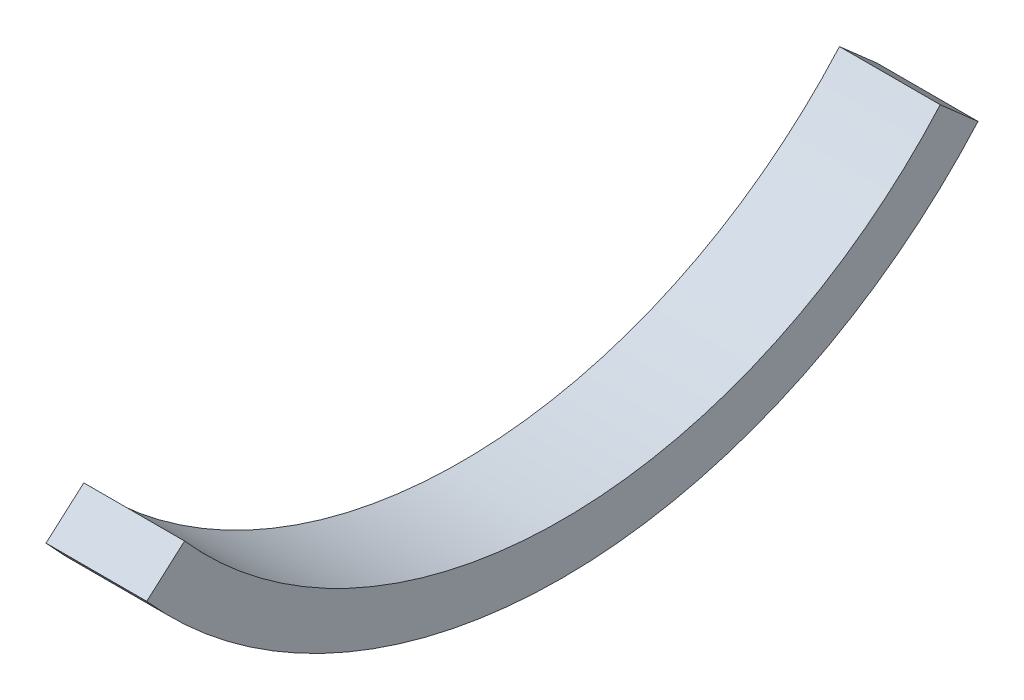
ISO-10303-21;
HEADER;
FILE_DESCRIPTION(('STEP AP214'),'2;1');
FILE_NAME('part.step','',(''),(''),'','','');
FILE_SCHEMA(('AUTOMOTIVE_DESIGN { 1 0 10303 214 1 1 1 1 }'));
ENDSEC;
DATA;
#1=APPLICATION_CONTEXT('core data for automotive mechanical design processes');
#2=APPLICATION_PROTOCOL_DEFINITION('international standard','automotive_design',2000,#1);
#3=PRODUCT_CONTEXT('',#1,'mechanical');
#4=PRODUCT('Part','Part','',(#3));
#5=PRODUCT_RELATED_PRODUCT_CATEGORY('part','',(#4));
#6=PRODUCT_DEFINITION_FORMATION('','',#4);
#7=PRODUCT_DEFINITION_CONTEXT('part definition',#1,'design');
#8=PRODUCT_DEFINITION('design','',#6,#7);
#9=PRODUCT_DEFINITION_SHAPE('','',#8);
#10=(LENGTH_UNIT() NAMED_UNIT(*) SI_UNIT(.MILLI.,.METRE.));
#11=(NAMED_UNIT(*) PLANE_ANGLE_UNIT() SI_UNIT($,.RADIAN.));
#12=(NAMED_UNIT(*) SI_UNIT($,.STERADIAN.) SOLID_ANGLE_UNIT());
#13=UNCERTAINTY_MEASURE_WITH_UNIT(LENGTH_MEASURE(1.E-05),#10,'distance_accuracy_value','');
#14=(GEOMETRIC_REPRESENTATION_CONTEXT(3) GLOBAL_UNCERTAINTY_ASSIGNED_CONTEXT((#13)) GLOBAL_UNIT_ASSIGNED_CONTEXT((#10,
#11,#12)) REPRESENTATION_CONTEXT('',''));
#15=CARTESIAN_POINT('',(0.,0.,0.));
#16=DIRECTION('',(0.,0.,1.));
#17=DIRECTION('',(1.,0.,0.));
#18=AXIS2_PLACEMENT_3D('',#15,#16,#17);
#19=CARTESIAN_POINT('',(5.08,0.,0.));
#20=DIRECTION('',(-1.,0.,0.));
#21=DIRECTION('',(0.,0.,1.));
#22=AXIS2_PLACEMENT_3D('',#19,#20,#21);
#23=CYLINDRICAL_SURFACE('',#22,25.4);
#24=CARTESIAN_POINT('',(0.,0.,0.));
#25=DIRECTION('',(-1.,0.,0.));
#26=DIRECTION('',(0.,0.,1.));
#27=AXIS2_PLACEMENT_3D('',#24,#25,#26);
#28=CIRCLE('',#27,25.4);
#29=CARTESIAN_POINT('',(0.,-16.8005208252601,-19.05));
#30=VERTEX_POINT('',#29);
#31=CARTESIAN_POINT('',(0.,-16.8005208252601,19.05));
#32=VERTEX_POINT('',#31);
#33=EDGE_CURVE('E96',#30,#32,#28,.T.);
#34=ORIENTED_EDGE('',*,*,#33,.T.);
#35=DIRECTION('',(-1.,0.,0.));
#36=VECTOR('',#35,1.);
#37=CARTESIAN_POINT('',(5.08,-16.8005208252601,19.05));
#38=LINE('',#37,#36);
#39=CARTESIAN_POINT('',(5.08,-16.8005208252601,19.05));
#40=VERTEX_POINT('',#39);
#41=EDGE_CURVE('E11',#40,#32,#38,.T.);
#42=ORIENTED_EDGE('',*,*,#41,.F.);
#43=CARTESIAN_POINT('',(5.08,0.,0.));
#44=DIRECTION('',(-1.,0.,0.));
#45=DIRECTION('',(0.,0.,1.));
#46=AXIS2_PLACEMENT_3D('',#43,#44,#45);
#47=CIRCLE('',#46,25.4);
#48=CARTESIAN_POINT('',(5.08,-16.8005208252601,-19.05));
#49=VERTEX_POINT('',#48);
#50=EDGE_CURVE('E84',#49,#40,#47,.T.);
#51=ORIENTED_EDGE('',*,*,#50,.F.);
#52=DIRECTION('',(-1.,0.,0.));
#53=VECTOR('',#52,1.);
#54=CARTESIAN_POINT('',(5.08,-16.8005208252601,-19.05));
#55=LINE('',#54,#53);
#56=EDGE_CURVE('E92',#49,#30,#55,.T.);
#57=ORIENTED_EDGE('',*,*,#56,.T.);
#58=EDGE_LOOP('',(#34,#42,#51,#57));
#59=FACE_BOUND('',#58,.T.);
#60=ADVANCED_FACE('F33',(#59),#23,.F.);
#61=CARTESIAN_POINT('',(5.08,-16.8005208252601,19.05));
#62=DIRECTION('',(0.,-0.750000000000001,-0.661437827766147));
#63=DIRECTION('',(0.,0.661437827766147,-0.750000000000001));
#64=AXIS2_PLACEMENT_3D('',#61,#62,#63);
#65=PLANE('',#64);
#66=DIRECTION('',(0.,-0.661437827766147,0.750000000000001));
#67=VECTOR('',#66,1.);
#68=CARTESIAN_POINT('',(0.,-16.8005208252601,19.05));
#69=LINE('',#68,#67);
#70=CARTESIAN_POINT('',(0.,-18.4805729077862,20.955));
#71=VERTEX_POINT('',#70);
#72=EDGE_CURVE('E88',#32,#71,#69,.T.);
#73=ORIENTED_EDGE('',*,*,#72,.T.);
#74=DIRECTION('',(-1.,0.,0.));
#75=VECTOR('',#74,1.);
#76=CARTESIAN_POINT('',(5.08,-18.4805729077862,20.955));
#77=LINE('',#76,#75);
#78=CARTESIAN_POINT('',(5.08,-18.4805729077862,20.955));
#79=VERTEX_POINT('',#78);
#80=EDGE_CURVE('E41',#79,#71,#77,.T.);
#81=ORIENTED_EDGE('',*,*,#80,.F.);
#82=DIRECTION('',(0.,-0.661437827766147,0.750000000000001));
#83=VECTOR('',#82,1.);
#84=CARTESIAN_POINT('',(5.08,-16.8005208252601,19.05));
#85=LINE('',#84,#83);
#86=EDGE_CURVE('E79',#40,#79,#85,.T.);
#87=ORIENTED_EDGE('',*,*,#86,.F.);
#88=ORIENTED_EDGE('',*,*,#41,.T.);
#89=EDGE_LOOP('',(#73,#81,#87,#88));
#90=FACE_BOUND('',#89,.T.);
#91=ADVANCED_FACE('F87',(#90),#65,.F.);
#92=CARTESIAN_POINT('',(5.08,0.,0.));
#93=DIRECTION('',(-1.,0.,0.));
#94=DIRECTION('',(0.,0.,1.));
#95=AXIS2_PLACEMENT_3D('',#92,#93,#94);
#96=CYLINDRICAL_SURFACE('',#95,27.94);
#97=CARTESIAN_POINT('',(0.,0.,0.));
#98=DIRECTION('',(1.,0.,0.));
#99=DIRECTION('',(0.,0.,1.));
#100=AXIS2_PLACEMENT_3D('',#97,#98,#99);
#101=CIRCLE('',#100,27.94);
#102=CARTESIAN_POINT('',(0.,-18.4805729077862,-20.955));
#103=VERTEX_POINT('',#102);
#104=EDGE_CURVE('E66',#71,#103,#101,.T.);
#105=ORIENTED_EDGE('',*,*,#104,.T.);
#106=DIRECTION('',(-1.,0.,0.));
#107=VECTOR('',#106,1.);
#108=CARTESIAN_POINT('',(5.08,-18.4805729077862,-20.955));
#109=LINE('',#108,#107);
#110=CARTESIAN_POINT('',(5.08,-18.4805729077862,-20.955));
#111=VERTEX_POINT('',#110);
#112=EDGE_CURVE('E89',#111,#103,#109,.T.);
#113=ORIENTED_EDGE('',*,*,#112,.F.);
#114=CARTESIAN_POINT('',(5.08,0.,0.));
#115=DIRECTION('',(1.,0.,0.));
#116=DIRECTION('',(0.,0.,1.));
#117=AXIS2_PLACEMENT_3D('',#114,#115,#116);
#118=CIRCLE('',#117,27.94);
#119=EDGE_CURVE('E82',#79,#111,#118,.T.);
#120=ORIENTED_EDGE('',*,*,#119,.F.);
#121=ORIENTED_EDGE('',*,*,#80,.T.);
#122=EDGE_LOOP('',(#105,#113,#120,#121));
#123=FACE_BOUND('',#122,.T.);
#124=ADVANCED_FACE('F90',(#123),#96,.T.);
#125=CARTESIAN_POINT('',(5.08,-18.4805729077862,-20.955));
#126=DIRECTION('',(0.,-0.750000000000001,0.661437827766146));
#127=DIRECTION('',(0.,-0.661437827766146,-0.750000000000001));
#128=AXIS2_PLACEMENT_3D('',#125,#126,#127);
#129=PLANE('',#128);
#130=DIRECTION('',(0.,0.661437827766146,0.750000000000001));
#131=VECTOR('',#130,1.);
#132=CARTESIAN_POINT('',(0.,-18.4805729077862,-20.955));
#133=LINE('',#132,#131);
#134=EDGE_CURVE('E72',#103,#30,#133,.T.);
#135=ORIENTED_EDGE('',*,*,#134,.T.);
#136=ORIENTED_EDGE('',*,*,#56,.F.);
#137=DIRECTION('',(0.,0.661437827766146,0.750000000000001));
#138=VECTOR('',#137,1.);
#139=CARTESIAN_POINT('',(5.08,-18.4805729077862,-20.955));
#140=LINE('',#139,#138);
#141=EDGE_CURVE('E49',#111,#49,#140,.T.);
#142=ORIENTED_EDGE('',*,*,#141,.F.);
#143=ORIENTED_EDGE('',*,*,#112,.T.);
#144=EDGE_LOOP('',(#135,#136,#142,#143));
#145=FACE_BOUND('',#144,.T.);
#146=ADVANCED_FACE('F103',(#145),#129,.F.);
#147=CARTESIAN_POINT('',(5.08,0.,0.));
#148=DIRECTION('',(-1.,0.,0.));
#149=DIRECTION('',(0.,0.,1.));
#150=AXIS2_PLACEMENT_3D('',#147,#148,#149);
#151=PLANE('',#150);
#152=ORIENTED_EDGE('',*,*,#50,.T.);
#153=ORIENTED_EDGE('',*,*,#86,.T.);
#154=ORIENTED_EDGE('',*,*,#119,.T.);
#155=ORIENTED_EDGE('',*,*,#141,.T.);
#156=EDGE_LOOP('',(#152,#153,#154,#155));
#157=FACE_BOUND('',#156,.T.);
#158=ADVANCED_FACE('F80',(#157),#151,.F.);
#159=CARTESIAN_POINT('',(0.,0.,0.));
#160=DIRECTION('',(-1.,0.,0.));
#161=DIRECTION('',(0.,0.,1.));
#162=AXIS2_PLACEMENT_3D('',#159,#160,#161);
#163=PLANE('',#162);
#164=ORIENTED_EDGE('',*,*,#33,.F.);
#165=ORIENTED_EDGE('',*,*,#134,.F.);
#166=ORIENTED_EDGE('',*,*,#104,.F.);
#167=ORIENTED_EDGE('',*,*,#72,.F.);
#168=EDGE_LOOP('',(#164,#165,#166,#167));
#169=FACE_BOUND('',#168,.T.);
#170=ADVANCED_FACE('F106',(#169),#163,.T.);
#171=CLOSED_SHELL('',(#60,#91,#124,#146,#158,#170));
#172=MANIFOLD_SOLID_BREP('B2',#171);
#173=ADVANCED_BREP_SHAPE_REPRESENTATION('',(#18,#172),#14);
#174=SHAPE_DEFINITION_REPRESENTATION(#9,#173);
ENDSEC;
END-ISO-10303-21;
